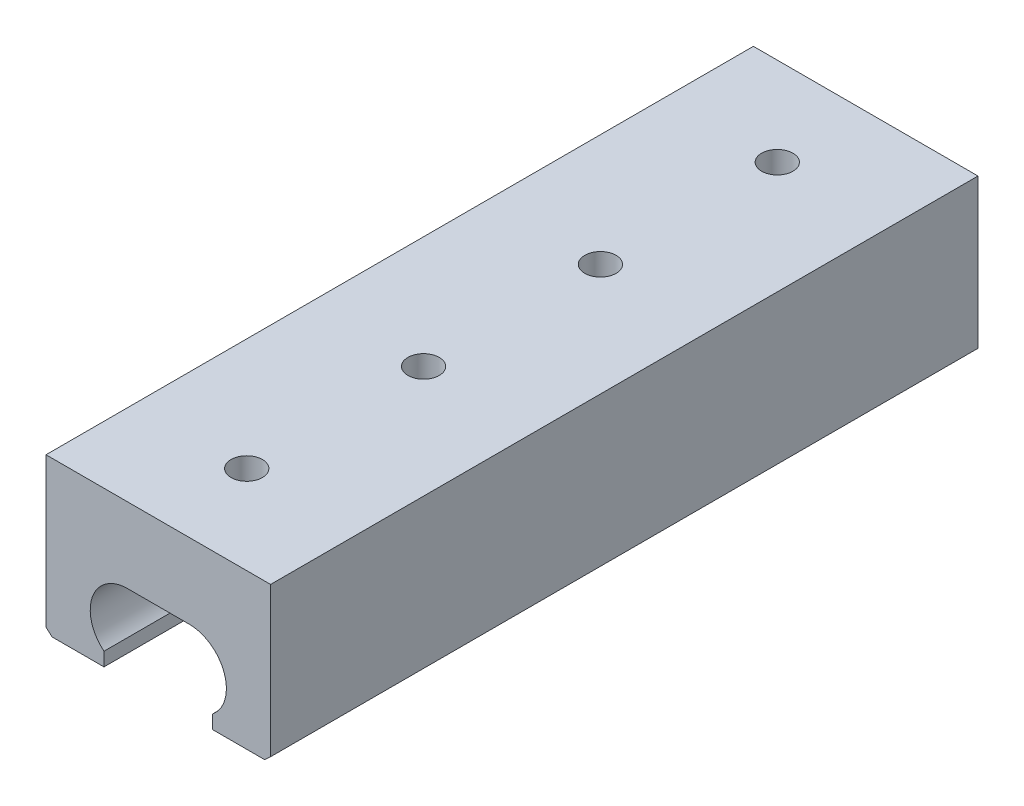
ISO-10303-21;
HEADER;
FILE_DESCRIPTION(('STEP AP214'),'2;1');
FILE_NAME('part.step','',(''),(''),'','','');
FILE_SCHEMA(('AUTOMOTIVE_DESIGN { 1 0 10303 214 1 1 1 1 }'));
ENDSEC;
DATA;
#1=APPLICATION_CONTEXT('core data for automotive mechanical design processes');
#2=APPLICATION_PROTOCOL_DEFINITION('international standard','automotive_design',2000,#1);
#3=PRODUCT_CONTEXT('',#1,'mechanical');
#4=PRODUCT('Part','Part','',(#3));
#5=PRODUCT_RELATED_PRODUCT_CATEGORY('part','',(#4));
#6=PRODUCT_DEFINITION_FORMATION('','',#4);
#7=PRODUCT_DEFINITION_CONTEXT('part definition',#1,'design');
#8=PRODUCT_DEFINITION('design','',#6,#7);
#9=PRODUCT_DEFINITION_SHAPE('','',#8);
#10=(LENGTH_UNIT() NAMED_UNIT(*) SI_UNIT(.MILLI.,.METRE.));
#11=(NAMED_UNIT(*) PLANE_ANGLE_UNIT() SI_UNIT($,.RADIAN.));
#12=(NAMED_UNIT(*) SI_UNIT($,.STERADIAN.) SOLID_ANGLE_UNIT());
#13=UNCERTAINTY_MEASURE_WITH_UNIT(LENGTH_MEASURE(1.E-05),#10,'distance_accuracy_value','');
#14=(GEOMETRIC_REPRESENTATION_CONTEXT(3) GLOBAL_UNCERTAINTY_ASSIGNED_CONTEXT((#13)) GLOBAL_UNIT_ASSIGNED_CONTEXT((#10,
#11,#12)) REPRESENTATION_CONTEXT('',''));
#15=CARTESIAN_POINT('',(0.,0.,0.));
#16=DIRECTION('',(0.,0.,1.));
#17=DIRECTION('',(1.,0.,0.));
#18=AXIS2_PLACEMENT_3D('',#15,#16,#17);
#19=CARTESIAN_POINT('',(-68.5063828996091,11.5130335390309,203.2));
#20=DIRECTION('',(1.,0.,0.));
#21=DIRECTION('',(0.,0.,-1.));
#22=AXIS2_PLACEMENT_3D('',#19,#20,#21);
#23=PLANE('',#22);
#24=DIRECTION('',(0.,-1.,0.));
#25=VECTOR('',#24,1.);
#26=CARTESIAN_POINT('',(-68.5063828996091,11.5130335390309,0.));
#27=LINE('',#26,#25);
#28=CARTESIAN_POINT('',(-68.5063828996091,11.5130335390309,0.));
#29=VERTEX_POINT('',#28);
#30=CARTESIAN_POINT('',(-68.5063828996091,-31.3555147627907,0.));
#31=VERTEX_POINT('',#30);
#32=EDGE_CURVE('E155',#29,#31,#27,.T.);
#33=ORIENTED_EDGE('',*,*,#32,.T.);
#34=DIRECTION('',(0.,0.,-1.));
#35=VECTOR('',#34,1.);
#36=CARTESIAN_POINT('',(-68.5063828996091,-31.3555147627907,203.2));
#37=LINE('',#36,#35);
#38=CARTESIAN_POINT('',(-68.5063828996091,-31.3555147627907,203.2));
#39=VERTEX_POINT('',#38);
#40=EDGE_CURVE('E203',#39,#31,#37,.T.);
#41=ORIENTED_EDGE('',*,*,#40,.F.);
#42=DIRECTION('',(0.,-1.,0.));
#43=VECTOR('',#42,1.);
#44=CARTESIAN_POINT('',(-68.5063828996091,11.5130335390309,203.2));
#45=LINE('',#44,#43);
#46=CARTESIAN_POINT('',(-68.5063828996091,11.5130335390309,203.2));
#47=VERTEX_POINT('',#46);
#48=EDGE_CURVE('E178',#47,#39,#45,.T.);
#49=ORIENTED_EDGE('',*,*,#48,.F.);
#50=DIRECTION('',(0.,0.,-1.));
#51=VECTOR('',#50,1.);
#52=CARTESIAN_POINT('',(-68.5063828996091,11.5130335390309,203.2));
#53=LINE('',#52,#51);
#54=EDGE_CURVE('E151',#47,#29,#53,.T.);
#55=ORIENTED_EDGE('',*,*,#54,.T.);
#56=EDGE_LOOP('',(#33,#41,#49,#55));
#57=FACE_BOUND('',#56,.T.);
#58=ADVANCED_FACE('F33',(#57),#23,.F.);
#59=CARTESIAN_POINT('',(-68.5063828996091,-31.3555147627907,203.2));
#60=DIRECTION('',(0.679560356484189,0.733619602992643,0.));
#61=DIRECTION('',(-0.733619602992643,0.679560356484189,0.));
#62=AXIS2_PLACEMENT_3D('',#59,#60,#61);
#63=PLANE('',#62);
#64=DIRECTION('',(0.733619602992643,-0.679560356484189,0.));
#65=VECTOR('',#64,1.);
#66=CARTESIAN_POINT('',(-68.5063828996091,-31.3555147627907,0.));
#67=LINE('',#66,#65);
#68=CARTESIAN_POINT('',(-66.7991262065142,-32.9369664609691,0.));
#69=VERTEX_POINT('',#68);
#70=EDGE_CURVE('E158',#31,#69,#67,.T.);
#71=ORIENTED_EDGE('',*,*,#70,.T.);
#72=DIRECTION('',(0.,0.,-1.));
#73=VECTOR('',#72,1.);
#74=CARTESIAN_POINT('',(-66.7991262065142,-32.9369664609691,203.2));
#75=LINE('',#74,#73);
#76=CARTESIAN_POINT('',(-66.7991262065142,-32.9369664609691,203.2));
#77=VERTEX_POINT('',#76);
#78=EDGE_CURVE('E200',#77,#69,#75,.T.);
#79=ORIENTED_EDGE('',*,*,#78,.F.);
#80=DIRECTION('',(0.733619602992643,-0.679560356484189,0.));
#81=VECTOR('',#80,1.);
#82=CARTESIAN_POINT('',(-68.5063828996091,-31.3555147627907,203.2));
#83=LINE('',#82,#81);
#84=EDGE_CURVE('E106',#39,#77,#83,.T.);
#85=ORIENTED_EDGE('',*,*,#84,.F.);
#86=ORIENTED_EDGE('',*,*,#40,.T.);
#87=EDGE_LOOP('',(#71,#79,#85,#86));
#88=FACE_BOUND('',#87,.T.);
#89=ADVANCED_FACE('F230',(#88),#63,.F.);
#90=CARTESIAN_POINT('',(-51.8484095418568,-32.9369664609691,203.2));
#91=DIRECTION('',(0.,1.,0.));
#92=DIRECTION('',(0.,0.,1.));
#93=AXIS2_PLACEMENT_3D('',#90,#91,#92);
#94=PLANE('',#93);
#95=DIRECTION('',(1.,0.,0.));
#96=VECTOR('',#95,1.);
#97=CARTESIAN_POINT('',(-51.8484095418568,-32.9369664609691,0.));
#98=LINE('',#97,#96);
#99=CARTESIAN_POINT('',(-51.8484095418568,-32.9369664609691,0.));
#100=VERTEX_POINT('',#99);
#101=EDGE_CURVE('E161',#69,#100,#98,.T.);
#102=ORIENTED_EDGE('',*,*,#101,.T.);
#103=DIRECTION('',(0.,0.,-1.));
#104=VECTOR('',#103,1.);
#105=CARTESIAN_POINT('',(-51.8484095418568,-32.9369664609691,203.2));
#106=LINE('',#105,#104);
#107=CARTESIAN_POINT('',(-51.8484095418568,-32.9369664609691,203.2));
#108=VERTEX_POINT('',#107);
#109=EDGE_CURVE('E197',#108,#100,#106,.T.);
#110=ORIENTED_EDGE('',*,*,#109,.F.);
#111=DIRECTION('',(1.,0.,0.));
#112=VECTOR('',#111,1.);
#113=CARTESIAN_POINT('',(-51.8484095418568,-32.9369664609691,203.2));
#114=LINE('',#113,#112);
#115=EDGE_CURVE('E321',#77,#108,#114,.T.);
#116=ORIENTED_EDGE('',*,*,#115,.F.);
#117=ORIENTED_EDGE('',*,*,#78,.T.);
#118=EDGE_LOOP('',(#102,#110,#116,#117));
#119=FACE_BOUND('',#118,.T.);
#120=ADVANCED_FACE('F236',(#119),#94,.F.);
#121=CARTESIAN_POINT('',(-51.8484095418568,-29.0298593773015,203.2));
#122=DIRECTION('',(-1.,0.,0.));
#123=DIRECTION('',(0.,-1.,0.));
#124=AXIS2_PLACEMENT_3D('',#121,#122,#123);
#125=PLANE('',#124);
#126=DIRECTION('',(0.,1.,0.));
#127=VECTOR('',#126,1.);
#128=CARTESIAN_POINT('',(-51.8484095418568,-29.0298593773015,0.));
#129=LINE('',#128,#127);
#130=CARTESIAN_POINT('',(-51.8484095418568,-29.0298593773015,0.));
#131=VERTEX_POINT('',#130);
#132=EDGE_CURVE('E163',#100,#131,#129,.T.);
#133=ORIENTED_EDGE('',*,*,#132,.T.);
#134=DIRECTION('',(0.,0.,-1.));
#135=VECTOR('',#134,1.);
#136=CARTESIAN_POINT('',(-51.8484095418568,-29.0298593773015,203.2));
#137=LINE('',#136,#135);
#138=CARTESIAN_POINT('',(-51.8484095418568,-29.0298593773015,203.2));
#139=VERTEX_POINT('',#138);
#140=EDGE_CURVE('E194',#139,#131,#137,.T.);
#141=ORIENTED_EDGE('',*,*,#140,.F.);
#142=DIRECTION('',(0.,1.,0.));
#143=VECTOR('',#142,1.);
#144=CARTESIAN_POINT('',(-51.8484095418568,-29.0298593773015,203.2));
#145=LINE('',#144,#143);
#146=EDGE_CURVE('E289',#108,#139,#145,.T.);
#147=ORIENTED_EDGE('',*,*,#146,.F.);
#148=ORIENTED_EDGE('',*,*,#109,.T.);
#149=EDGE_LOOP('',(#133,#141,#147,#148));
#150=FACE_BOUND('',#149,.T.);
#151=ADVANCED_FACE('F269',(#150),#125,.F.);
#152=CARTESIAN_POINT('',(-45.1383828996091,-20.7363820330069,203.2));
#153=DIRECTION('',(0.,0.,-1.));
#154=DIRECTION('',(-1.,0.,0.));
#155=AXIS2_PLACEMENT_3D('',#152,#153,#154);
#156=CYLINDRICAL_SURFACE('',#155,10.668);
#157=CARTESIAN_POINT('',(-45.1383828996091,-20.7363820330069,0.));
#158=DIRECTION('',(0.,0.,-1.));
#159=DIRECTION('',(1.,0.,0.));
#160=AXIS2_PLACEMENT_3D('',#157,#158,#159);
#161=CIRCLE('',#160,10.668);
#162=CARTESIAN_POINT('',(-45.1383828996091,-10.068382033007,0.));
#163=VERTEX_POINT('',#162);
#164=EDGE_CURVE('E165',#131,#163,#161,.T.);
#165=ORIENTED_EDGE('',*,*,#164,.T.);
#166=DIRECTION('',(0.,0.,-1.));
#167=VECTOR('',#166,1.);
#168=CARTESIAN_POINT('',(-45.1383828996091,-10.068382033007,203.2));
#169=LINE('',#168,#167);
#170=CARTESIAN_POINT('',(-45.1383828996091,-10.068382033007,203.2));
#171=VERTEX_POINT('',#170);
#172=EDGE_CURVE('E191',#171,#163,#169,.T.);
#173=ORIENTED_EDGE('',*,*,#172,.F.);
#174=CARTESIAN_POINT('',(-45.1383828996091,-20.7363820330069,203.2));
#175=DIRECTION('',(0.,0.,-1.));
#176=DIRECTION('',(1.,0.,0.));
#177=AXIS2_PLACEMENT_3D('',#174,#175,#176);
#178=CIRCLE('',#177,10.668);
#179=EDGE_CURVE('E302',#139,#171,#178,.T.);
#180=ORIENTED_EDGE('',*,*,#179,.F.);
#181=ORIENTED_EDGE('',*,*,#140,.T.);
#182=EDGE_LOOP('',(#165,#173,#180,#181));
#183=FACE_BOUND('',#182,.T.);
#184=ADVANCED_FACE('F258',(#183),#156,.F.);
#185=CARTESIAN_POINT('',(-45.1383828996091,-10.068382033007,203.2));
#186=DIRECTION('',(0.,1.,0.));
#187=DIRECTION('',(-1.,0.,0.));
#188=AXIS2_PLACEMENT_3D('',#185,#186,#187);
#189=PLANE('',#188);
#190=CARTESIAN_POINT('',(-36.2483828996099,-10.068382033007,127.));
#191=DIRECTION('',(0.,1.,0.));
#192=DIRECTION('',(-1.,0.,0.));
#193=AXIS2_PLACEMENT_3D('',#190,#191,#192);
#194=CIRCLE('',#193,4.49999999999999);
#195=CARTESIAN_POINT('',(-40.7483828996098,-10.068382033007,127.));
#196=VERTEX_POINT('',#195);
#197=EDGE_CURVE('E330',#196,#196,#194,.T.);
#198=ORIENTED_EDGE('',*,*,#197,.T.);
#199=EDGE_LOOP('',(#198));
#200=FACE_BOUND('',#199,.T.);
#201=CARTESIAN_POINT('',(-36.2483828996099,-10.068382033007,177.8));
#202=DIRECTION('',(0.,1.,0.));
#203=DIRECTION('',(-1.,0.,0.));
#204=AXIS2_PLACEMENT_3D('',#201,#202,#203);
#205=CIRCLE('',#204,4.49999999999999);
#206=CARTESIAN_POINT('',(-40.7483828996098,-10.068382033007,177.8));
#207=VERTEX_POINT('',#206);
#208=EDGE_CURVE('E159',#207,#207,#205,.T.);
#209=ORIENTED_EDGE('',*,*,#208,.T.);
#210=EDGE_LOOP('',(#209));
#211=FACE_BOUND('',#210,.T.);
#212=DIRECTION('',(1.,0.,0.));
#213=VECTOR('',#212,1.);
#214=CARTESIAN_POINT('',(-45.1383828996091,-10.068382033007,0.));
#215=LINE('',#214,#213);
#216=CARTESIAN_POINT('',(-27.3583828996091,-10.068382033007,0.));
#217=VERTEX_POINT('',#216);
#218=EDGE_CURVE('E167',#163,#217,#215,.T.);
#219=ORIENTED_EDGE('',*,*,#218,.T.);
#220=DIRECTION('',(0.,0.,-1.));
#221=VECTOR('',#220,1.);
#222=CARTESIAN_POINT('',(-27.3583828996091,-10.068382033007,203.2));
#223=LINE('',#222,#221);
#224=CARTESIAN_POINT('',(-27.3583828996091,-10.068382033007,203.2));
#225=VERTEX_POINT('',#224);
#226=EDGE_CURVE('E188',#225,#217,#223,.T.);
#227=ORIENTED_EDGE('',*,*,#226,.F.);
#228=DIRECTION('',(1.,0.,0.));
#229=VECTOR('',#228,1.);
#230=CARTESIAN_POINT('',(-45.1383828996091,-10.068382033007,203.2));
#231=LINE('',#230,#229);
#232=EDGE_CURVE('E299',#171,#225,#231,.T.);
#233=ORIENTED_EDGE('',*,*,#232,.F.);
#234=ORIENTED_EDGE('',*,*,#172,.T.);
#235=EDGE_LOOP('',(#219,#227,#233,#234));
#236=FACE_BOUND('',#235,.T.);
#237=CARTESIAN_POINT('',(-36.2483828996099,-10.068382033007,76.2));
#238=DIRECTION('',(0.,1.,0.));
#239=DIRECTION('',(-1.,0.,0.));
#240=AXIS2_PLACEMENT_3D('',#237,#238,#239);
#241=CIRCLE('',#240,4.49999999999999);
#242=CARTESIAN_POINT('',(-40.7483828996098,-10.068382033007,76.2));
#243=VERTEX_POINT('',#242);
#244=EDGE_CURVE('E208',#243,#243,#241,.T.);
#245=ORIENTED_EDGE('',*,*,#244,.T.);
#246=EDGE_LOOP('',(#245));
#247=FACE_BOUND('',#246,.T.);
#248=CARTESIAN_POINT('',(-36.2483828996099,-10.068382033007,25.4));
#249=DIRECTION('',(0.,1.,0.));
#250=DIRECTION('',(-1.,0.,0.));
#251=AXIS2_PLACEMENT_3D('',#248,#249,#250);
#252=CIRCLE('',#251,4.49999999999999);
#253=CARTESIAN_POINT('',(-40.7483828996098,-10.068382033007,25.4));
#254=VERTEX_POINT('',#253);
#255=EDGE_CURVE('E11',#254,#254,#252,.T.);
#256=ORIENTED_EDGE('',*,*,#255,.T.);
#257=EDGE_LOOP('',(#256));
#258=FACE_BOUND('',#257,.T.);
#259=ADVANCED_FACE('F254',(#200,#211,#236,#247,#258),#189,.F.);
#260=CARTESIAN_POINT('',(-27.3583828996091,-20.7363820330069,203.2));
#261=DIRECTION('',(0.,0.,-1.));
#262=DIRECTION('',(-1.,0.,0.));
#263=AXIS2_PLACEMENT_3D('',#260,#261,#262);
#264=CYLINDRICAL_SURFACE('',#263,10.668);
#265=CARTESIAN_POINT('',(-27.3583828996091,-20.7363820330069,0.));
#266=DIRECTION('',(0.,0.,-1.));
#267=DIRECTION('',(-1.,0.,0.));
#268=AXIS2_PLACEMENT_3D('',#265,#266,#267);
#269=CIRCLE('',#268,10.668);
#270=CARTESIAN_POINT('',(-20.6483562573615,-29.0298593773015,0.));
#271=VERTEX_POINT('',#270);
#272=EDGE_CURVE('E169',#217,#271,#269,.T.);
#273=ORIENTED_EDGE('',*,*,#272,.T.);
#274=DIRECTION('',(0.,0.,-1.));
#275=VECTOR('',#274,1.);
#276=CARTESIAN_POINT('',(-20.6483562573615,-29.0298593773015,203.2));
#277=LINE('',#276,#275);
#278=CARTESIAN_POINT('',(-20.6483562573615,-29.0298593773015,203.2));
#279=VERTEX_POINT('',#278);
#280=EDGE_CURVE('E185',#279,#271,#277,.T.);
#281=ORIENTED_EDGE('',*,*,#280,.F.);
#282=CARTESIAN_POINT('',(-27.3583828996091,-20.7363820330069,203.2));
#283=DIRECTION('',(0.,0.,-1.));
#284=DIRECTION('',(-1.,0.,0.));
#285=AXIS2_PLACEMENT_3D('',#282,#283,#284);
#286=CIRCLE('',#285,10.668);
#287=EDGE_CURVE('E301',#225,#279,#286,.T.);
#288=ORIENTED_EDGE('',*,*,#287,.F.);
#289=ORIENTED_EDGE('',*,*,#226,.T.);
#290=EDGE_LOOP('',(#273,#281,#288,#289));
#291=FACE_BOUND('',#290,.T.);
#292=ADVANCED_FACE('F257',(#291),#264,.F.);
#293=CARTESIAN_POINT('',(-20.6483562573615,-29.0298593773015,203.2));
#294=DIRECTION('',(1.,0.,0.));
#295=DIRECTION('',(0.,1.,0.));
#296=AXIS2_PLACEMENT_3D('',#293,#294,#295);
#297=PLANE('',#296);
#298=DIRECTION('',(0.,-1.,0.));
#299=VECTOR('',#298,1.);
#300=CARTESIAN_POINT('',(-20.6483562573615,-29.0298593773015,0.));
#301=LINE('',#300,#299);
#302=CARTESIAN_POINT('',(-20.6483562573614,-32.9369664609691,0.));
#303=VERTEX_POINT('',#302);
#304=EDGE_CURVE('E171',#271,#303,#301,.T.);
#305=ORIENTED_EDGE('',*,*,#304,.T.);
#306=DIRECTION('',(0.,0.,-1.));
#307=VECTOR('',#306,1.);
#308=CARTESIAN_POINT('',(-20.6483562573614,-32.9369664609691,203.2));
#309=LINE('',#308,#307);
#310=CARTESIAN_POINT('',(-20.6483562573614,-32.9369664609691,203.2));
#311=VERTEX_POINT('',#310);
#312=EDGE_CURVE('E182',#311,#303,#309,.T.);
#313=ORIENTED_EDGE('',*,*,#312,.F.);
#314=DIRECTION('',(0.,-1.,0.));
#315=VECTOR('',#314,1.);
#316=CARTESIAN_POINT('',(-20.6483562573615,-29.0298593773015,203.2));
#317=LINE('',#316,#315);
#318=EDGE_CURVE('E304',#279,#311,#317,.T.);
#319=ORIENTED_EDGE('',*,*,#318,.F.);
#320=ORIENTED_EDGE('',*,*,#280,.T.);
#321=EDGE_LOOP('',(#305,#313,#319,#320));
#322=FACE_BOUND('',#321,.T.);
#323=ADVANCED_FACE('F266',(#322),#297,.F.);
#324=CARTESIAN_POINT('',(-20.6483562573614,-32.9369664609691,203.2));
#325=DIRECTION('',(0.,1.,0.));
#326=DIRECTION('',(-1.,0.,0.));
#327=AXIS2_PLACEMENT_3D('',#324,#325,#326);
#328=PLANE('',#327);
#329=DIRECTION('',(1.,0.,0.));
#330=VECTOR('',#329,1.);
#331=CARTESIAN_POINT('',(-20.6483562573614,-32.9369664609691,0.));
#332=LINE('',#331,#330);
#333=CARTESIAN_POINT('',(-5.69763959270406,-32.9369664609691,0.));
#334=VERTEX_POINT('',#333);
#335=EDGE_CURVE('E173',#303,#334,#332,.T.);
#336=ORIENTED_EDGE('',*,*,#335,.T.);
#337=DIRECTION('',(0.,0.,-1.));
#338=VECTOR('',#337,1.);
#339=CARTESIAN_POINT('',(-5.69763959270406,-32.9369664609691,203.2));
#340=LINE('',#339,#338);
#341=CARTESIAN_POINT('',(-5.69763959270406,-32.9369664609691,203.2));
#342=VERTEX_POINT('',#341);
#343=EDGE_CURVE('E146',#342,#334,#340,.T.);
#344=ORIENTED_EDGE('',*,*,#343,.F.);
#345=DIRECTION('',(1.,0.,0.));
#346=VECTOR('',#345,1.);
#347=CARTESIAN_POINT('',(-20.6483562573614,-32.9369664609691,203.2));
#348=LINE('',#347,#346);
#349=EDGE_CURVE('E137',#311,#342,#348,.T.);
#350=ORIENTED_EDGE('',*,*,#349,.F.);
#351=ORIENTED_EDGE('',*,*,#312,.T.);
#352=EDGE_LOOP('',(#336,#344,#350,#351));
#353=FACE_BOUND('',#352,.T.);
#354=ADVANCED_FACE('F316',(#353),#328,.F.);
#355=CARTESIAN_POINT('',(-3.9903828996091,-31.3555147627907,203.2));
#356=DIRECTION('',(-0.679560356484187,0.733619602992644,0.));
#357=DIRECTION('',(-0.733619602992644,-0.679560356484187,0.));
#358=AXIS2_PLACEMENT_3D('',#355,#356,#357);
#359=PLANE('',#358);
#360=DIRECTION('',(0.733619602992644,0.679560356484187,0.));
#361=VECTOR('',#360,1.);
#362=CARTESIAN_POINT('',(-3.9903828996091,-31.3555147627907,0.));
#363=LINE('',#362,#361);
#364=CARTESIAN_POINT('',(-3.9903828996091,-31.3555147627907,0.));
#365=VERTEX_POINT('',#364);
#366=EDGE_CURVE('E145',#334,#365,#363,.T.);
#367=ORIENTED_EDGE('',*,*,#366,.T.);
#368=DIRECTION('',(0.,0.,-1.));
#369=VECTOR('',#368,1.);
#370=CARTESIAN_POINT('',(-3.9903828996091,-31.3555147627907,203.2));
#371=LINE('',#370,#369);
#372=CARTESIAN_POINT('',(-3.9903828996091,-31.3555147627907,203.2));
#373=VERTEX_POINT('',#372);
#374=EDGE_CURVE('E142',#373,#365,#371,.T.);
#375=ORIENTED_EDGE('',*,*,#374,.F.);
#376=DIRECTION('',(0.733619602992644,0.679560356484187,0.));
#377=VECTOR('',#376,1.);
#378=CARTESIAN_POINT('',(-3.9903828996091,-31.3555147627907,203.2));
#379=LINE('',#378,#377);
#380=EDGE_CURVE('E131',#342,#373,#379,.T.);
#381=ORIENTED_EDGE('',*,*,#380,.F.);
#382=ORIENTED_EDGE('',*,*,#343,.T.);
#383=EDGE_LOOP('',(#367,#375,#381,#382));
#384=FACE_BOUND('',#383,.T.);
#385=ADVANCED_FACE('F143',(#384),#359,.F.);
#386=CARTESIAN_POINT('',(-3.99038289960914,11.5130335390309,203.2));
#387=DIRECTION('',(-1.,0.,0.));
#388=DIRECTION('',(0.,-1.,0.));
#389=AXIS2_PLACEMENT_3D('',#386,#387,#388);
#390=PLANE('',#389);
#391=DIRECTION('',(0.,1.,0.));
#392=VECTOR('',#391,1.);
#393=CARTESIAN_POINT('',(-3.99038289960914,11.5130335390309,0.));
#394=LINE('',#393,#392);
#395=CARTESIAN_POINT('',(-3.99038289960914,11.5130335390309,0.));
#396=VERTEX_POINT('',#395);
#397=EDGE_CURVE('E91',#365,#396,#394,.T.);
#398=ORIENTED_EDGE('',*,*,#397,.T.);
#399=DIRECTION('',(0.,0.,-1.));
#400=VECTOR('',#399,1.);
#401=CARTESIAN_POINT('',(-3.99038289960914,11.5130335390309,203.2));
#402=LINE('',#401,#400);
#403=CARTESIAN_POINT('',(-3.99038289960914,11.5130335390309,203.2));
#404=VERTEX_POINT('',#403);
#405=EDGE_CURVE('E147',#404,#396,#402,.T.);
#406=ORIENTED_EDGE('',*,*,#405,.F.);
#407=DIRECTION('',(0.,1.,0.));
#408=VECTOR('',#407,1.);
#409=CARTESIAN_POINT('',(-3.99038289960914,11.5130335390309,203.2));
#410=LINE('',#409,#408);
#411=EDGE_CURVE('E135',#373,#404,#410,.T.);
#412=ORIENTED_EDGE('',*,*,#411,.F.);
#413=ORIENTED_EDGE('',*,*,#374,.T.);
#414=EDGE_LOOP('',(#398,#406,#412,#413));
#415=FACE_BOUND('',#414,.T.);
#416=ADVANCED_FACE('F149',(#415),#390,.F.);
#417=CARTESIAN_POINT('',(-68.5063828996091,11.5130335390309,203.2));
#418=DIRECTION('',(0.,-1.,0.));
#419=DIRECTION('',(1.,0.,0.));
#420=AXIS2_PLACEMENT_3D('',#417,#418,#419);
#421=PLANE('',#420);
#422=CARTESIAN_POINT('',(-36.2483828996099,11.5130335390309,127.));
#423=DIRECTION('',(0.,1.,0.));
#424=DIRECTION('',(0.,0.,1.));
#425=AXIS2_PLACEMENT_3D('',#422,#423,#424);
#426=CIRCLE('',#425,4.5);
#427=CARTESIAN_POINT('',(-36.2483828996099,11.5130335390309,131.5));
#428=VERTEX_POINT('',#427);
#429=EDGE_CURVE('E332',#428,#428,#426,.T.);
#430=ORIENTED_EDGE('',*,*,#429,.F.);
#431=EDGE_LOOP('',(#430));
#432=FACE_BOUND('',#431,.T.);
#433=CARTESIAN_POINT('',(-36.2483828996099,11.5130335390309,177.8));
#434=DIRECTION('',(0.,1.,0.));
#435=DIRECTION('',(0.,0.,1.));
#436=AXIS2_PLACEMENT_3D('',#433,#434,#435);
#437=CIRCLE('',#436,4.5);
#438=CARTESIAN_POINT('',(-36.2483828996099,11.5130335390309,182.3));
#439=VERTEX_POINT('',#438);
#440=EDGE_CURVE('E327',#439,#439,#437,.T.);
#441=ORIENTED_EDGE('',*,*,#440,.F.);
#442=EDGE_LOOP('',(#441));
#443=FACE_BOUND('',#442,.T.);
#444=DIRECTION('',(-1.,0.,0.));
#445=VECTOR('',#444,1.);
#446=CARTESIAN_POINT('',(-68.5063828996091,11.5130335390309,0.));
#447=LINE('',#446,#445);
#448=EDGE_CURVE('E97',#396,#29,#447,.T.);
#449=ORIENTED_EDGE('',*,*,#448,.T.);
#450=ORIENTED_EDGE('',*,*,#54,.F.);
#451=DIRECTION('',(-1.,0.,0.));
#452=VECTOR('',#451,1.);
#453=CARTESIAN_POINT('',(-68.5063828996091,11.5130335390309,203.2));
#454=LINE('',#453,#452);
#455=EDGE_CURVE('E50',#404,#47,#454,.T.);
#456=ORIENTED_EDGE('',*,*,#455,.F.);
#457=ORIENTED_EDGE('',*,*,#405,.T.);
#458=EDGE_LOOP('',(#449,#450,#456,#457));
#459=FACE_BOUND('',#458,.T.);
#460=CARTESIAN_POINT('',(-36.2483828996099,11.5130335390309,76.2));
#461=DIRECTION('',(0.,1.,0.));
#462=DIRECTION('',(0.,0.,1.));
#463=AXIS2_PLACEMENT_3D('',#460,#461,#462);
#464=CIRCLE('',#463,4.5);
#465=CARTESIAN_POINT('',(-36.2483828996099,11.5130335390309,80.7));
#466=VERTEX_POINT('',#465);
#467=EDGE_CURVE('E205',#466,#466,#464,.T.);
#468=ORIENTED_EDGE('',*,*,#467,.F.);
#469=EDGE_LOOP('',(#468));
#470=FACE_BOUND('',#469,.T.);
#471=CARTESIAN_POINT('',(-36.2483828996099,11.5130335390309,25.4));
#472=DIRECTION('',(0.,1.,0.));
#473=DIRECTION('',(0.,0.,1.));
#474=AXIS2_PLACEMENT_3D('',#471,#472,#473);
#475=CIRCLE('',#474,4.5);
#476=CARTESIAN_POINT('',(-36.2483828996099,11.5130335390309,29.9));
#477=VERTEX_POINT('',#476);
#478=EDGE_CURVE('E42',#477,#477,#475,.T.);
#479=ORIENTED_EDGE('',*,*,#478,.F.);
#480=EDGE_LOOP('',(#479));
#481=FACE_BOUND('',#480,.T.);
#482=ADVANCED_FACE('F215',(#432,#443,#459,#470,#481),#421,.F.);
#483=CARTESIAN_POINT('',(-45.1383828996091,-20.7363820330069,203.2));
#484=DIRECTION('',(0.,0.,1.));
#485=DIRECTION('',(1.,0.,0.));
#486=AXIS2_PLACEMENT_3D('',#483,#484,#485);
#487=PLANE('',#486);
#488=ORIENTED_EDGE('',*,*,#48,.T.);
#489=ORIENTED_EDGE('',*,*,#84,.T.);
#490=ORIENTED_EDGE('',*,*,#115,.T.);
#491=ORIENTED_EDGE('',*,*,#146,.T.);
#492=ORIENTED_EDGE('',*,*,#179,.T.);
#493=ORIENTED_EDGE('',*,*,#232,.T.);
#494=ORIENTED_EDGE('',*,*,#287,.T.);
#495=ORIENTED_EDGE('',*,*,#318,.T.);
#496=ORIENTED_EDGE('',*,*,#349,.T.);
#497=ORIENTED_EDGE('',*,*,#380,.T.);
#498=ORIENTED_EDGE('',*,*,#411,.T.);
#499=ORIENTED_EDGE('',*,*,#455,.T.);
#500=EDGE_LOOP('',(#488,#489,#490,#491,#492,#493,#494,#495,#496,#497,#498,#499));
#501=FACE_BOUND('',#500,.T.);
#502=ADVANCED_FACE('F133',(#501),#487,.T.);
#503=CARTESIAN_POINT('',(-45.1383828996091,-20.7363820330069,0.));
#504=DIRECTION('',(0.,0.,1.));
#505=DIRECTION('',(1.,0.,0.));
#506=AXIS2_PLACEMENT_3D('',#503,#504,#505);
#507=PLANE('',#506);
#508=ORIENTED_EDGE('',*,*,#32,.F.);
#509=ORIENTED_EDGE('',*,*,#448,.F.);
#510=ORIENTED_EDGE('',*,*,#397,.F.);
#511=ORIENTED_EDGE('',*,*,#366,.F.);
#512=ORIENTED_EDGE('',*,*,#335,.F.);
#513=ORIENTED_EDGE('',*,*,#304,.F.);
#514=ORIENTED_EDGE('',*,*,#272,.F.);
#515=ORIENTED_EDGE('',*,*,#218,.F.);
#516=ORIENTED_EDGE('',*,*,#164,.F.);
#517=ORIENTED_EDGE('',*,*,#132,.F.);
#518=ORIENTED_EDGE('',*,*,#101,.F.);
#519=ORIENTED_EDGE('',*,*,#70,.F.);
#520=EDGE_LOOP('',(#508,#509,#510,#511,#512,#513,#514,#515,#516,#517,#518,#519));
#521=FACE_BOUND('',#520,.T.);
#522=ADVANCED_FACE('F223',(#521),#507,.F.);
#523=CARTESIAN_POINT('',(-36.2483828996099,11.5130335390309,177.8));
#524=DIRECTION('',(0.,1.,0.));
#525=DIRECTION('',(0.,0.,1.));
#526=AXIS2_PLACEMENT_3D('',#523,#524,#525);
#527=CYLINDRICAL_SURFACE('',#526,4.49999999999999);
#528=ORIENTED_EDGE('',*,*,#440,.T.);
#529=EDGE_LOOP('',(#528));
#530=FACE_BOUND('',#529,.T.);
#531=ORIENTED_EDGE('',*,*,#208,.F.);
#532=EDGE_LOOP('',(#531));
#533=FACE_BOUND('',#532,.T.);
#534=ADVANCED_FACE('F247',(#530,#533),#527,.F.);
#535=CARTESIAN_POINT('',(-36.2483828996099,11.5130335390309,127.));
#536=DIRECTION('',(0.,1.,0.));
#537=DIRECTION('',(0.,0.,1.));
#538=AXIS2_PLACEMENT_3D('',#535,#536,#537);
#539=CYLINDRICAL_SURFACE('',#538,4.49999999999999);
#540=ORIENTED_EDGE('',*,*,#429,.T.);
#541=EDGE_LOOP('',(#540));
#542=FACE_BOUND('',#541,.T.);
#543=ORIENTED_EDGE('',*,*,#197,.F.);
#544=EDGE_LOOP('',(#543));
#545=FACE_BOUND('',#544,.T.);
#546=ADVANCED_FACE('F241',(#542,#545),#539,.F.);
#547=CARTESIAN_POINT('',(-36.2483828996099,11.5130335390309,76.2));
#548=DIRECTION('',(0.,1.,0.));
#549=DIRECTION('',(0.,0.,1.));
#550=AXIS2_PLACEMENT_3D('',#547,#548,#549);
#551=CYLINDRICAL_SURFACE('',#550,4.49999999999999);
#552=ORIENTED_EDGE('',*,*,#467,.T.);
#553=EDGE_LOOP('',(#552));
#554=FACE_BOUND('',#553,.T.);
#555=ORIENTED_EDGE('',*,*,#244,.F.);
#556=EDGE_LOOP('',(#555));
#557=FACE_BOUND('',#556,.T.);
#558=ADVANCED_FACE('F239',(#554,#557),#551,.F.);
#559=CARTESIAN_POINT('',(-36.2483828996099,11.5130335390309,25.4));
#560=DIRECTION('',(0.,1.,0.));
#561=DIRECTION('',(0.,0.,1.));
#562=AXIS2_PLACEMENT_3D('',#559,#560,#561);
#563=CYLINDRICAL_SURFACE('',#562,4.49999999999999);
#564=ORIENTED_EDGE('',*,*,#478,.T.);
#565=EDGE_LOOP('',(#564));
#566=FACE_BOUND('',#565,.T.);
#567=ORIENTED_EDGE('',*,*,#255,.F.);
#568=EDGE_LOOP('',(#567));
#569=FACE_BOUND('',#568,.T.);
#570=ADVANCED_FACE('F35',(#566,#569),#563,.F.);
#571=CLOSED_SHELL('',(#58,#89,#120,#151,#184,#259,#292,#323,#354,#385,#416,#482,#502,#522,#534,
#546,#558,#570));
#572=MANIFOLD_SOLID_BREP('B2',#571);
#573=ADVANCED_BREP_SHAPE_REPRESENTATION('',(#18,#572),#14);
#574=SHAPE_DEFINITION_REPRESENTATION(#9,#573);
ENDSEC;
END-ISO-10303-21;
